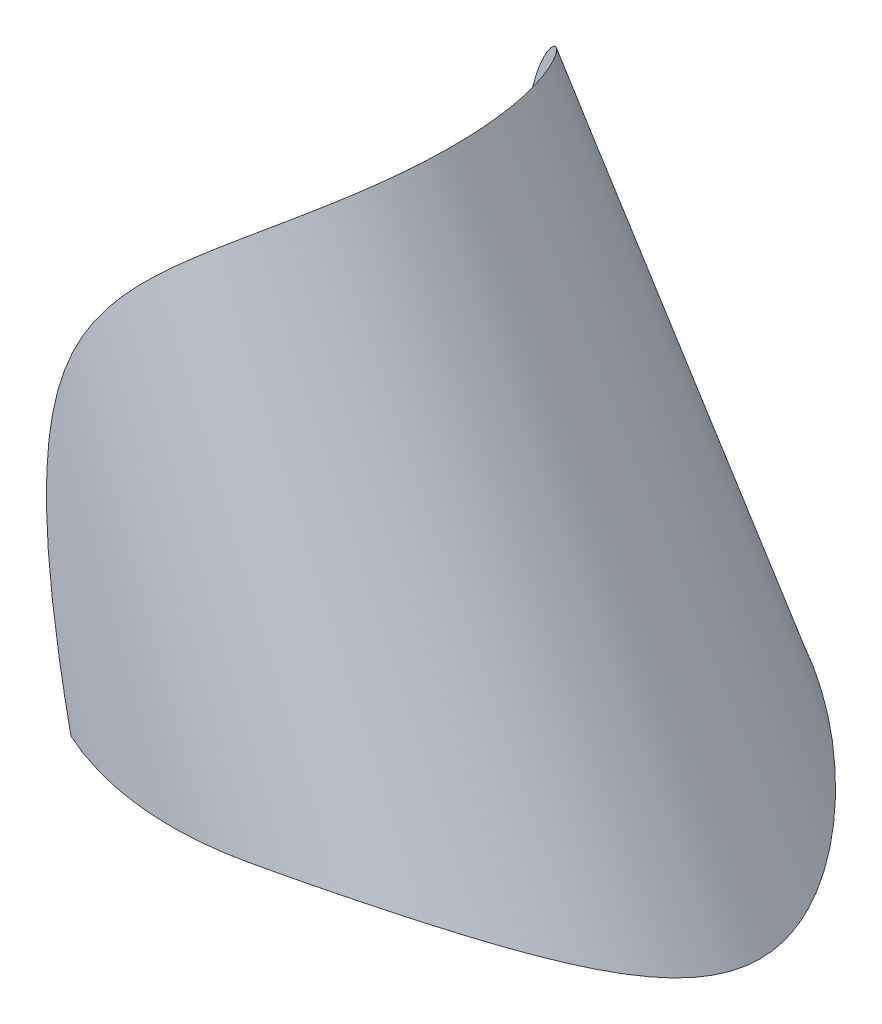
ISO-10303-21;
HEADER;
FILE_DESCRIPTION(('STEP AP214'),'2;1');
FILE_NAME('part.step','',(''),(''),'','','');
FILE_SCHEMA(('AUTOMOTIVE_DESIGN { 1 0 10303 214 1 1 1 1 }'));
ENDSEC;
DATA;
#1=APPLICATION_CONTEXT('core data for automotive mechanical design processes');
#2=APPLICATION_PROTOCOL_DEFINITION('international standard','automotive_design',2000,#1);
#3=PRODUCT_CONTEXT('',#1,'mechanical');
#4=PRODUCT('Part','Part','',(#3));
#5=PRODUCT_RELATED_PRODUCT_CATEGORY('part','',(#4));
#6=PRODUCT_DEFINITION_FORMATION('','',#4);
#7=PRODUCT_DEFINITION_CONTEXT('part definition',#1,'design');
#8=PRODUCT_DEFINITION('design','',#6,#7);
#9=PRODUCT_DEFINITION_SHAPE('','',#8);
#10=(LENGTH_UNIT() NAMED_UNIT(*) SI_UNIT(.MILLI.,.METRE.));
#11=(NAMED_UNIT(*) PLANE_ANGLE_UNIT() SI_UNIT($,.RADIAN.));
#12=(NAMED_UNIT(*) SI_UNIT($,.STERADIAN.) SOLID_ANGLE_UNIT());
#13=UNCERTAINTY_MEASURE_WITH_UNIT(LENGTH_MEASURE(1.E-05),#10,'distance_accuracy_value','');
#14=(GEOMETRIC_REPRESENTATION_CONTEXT(3) GLOBAL_UNCERTAINTY_ASSIGNED_CONTEXT((#13)) GLOBAL_UNIT_ASSIGNED_CONTEXT((#10,
#11,#12)) REPRESENTATION_CONTEXT('',''));
#15=CARTESIAN_POINT('',(0.,0.,0.));
#16=DIRECTION('',(0.,0.,1.));
#17=DIRECTION('',(1.,0.,0.));
#18=AXIS2_PLACEMENT_3D('',#15,#16,#17);
#19=CARTESIAN_POINT('',(35.761144135082,-12.3779103548701,0.));
#20=DIRECTION('',(0.422618261740701,-0.90630778703665,0.));
#21=DIRECTION('',(0.90630778703665,0.422618261740701,0.));
#22=AXIS2_PLACEMENT_3D('',#19,#20,#21);
#23=CONICAL_SURFACE('',#22,17.4576231620508,0.0737888713049141);
#24=CARTESIAN_POINT('',(34.9998,-6.66633415136175E-10,15.9715201922678));
#25=CARTESIAN_POINT('',(35.3236106019589,1.21896389362089E-05,15.8985949983167));
#26=CARTESIAN_POINT('',(35.6457566196141,-0.00523801429899876,15.8184619106437));
#27=CARTESIAN_POINT('',(36.2859291135126,-0.0258651280964723,15.6445389671018));
#28=CARTESIAN_POINT('',(36.603956631235,-0.0412394247097111,15.5507526402926));
#29=CARTESIAN_POINT('',(37.2347878928871,-0.0816861594505489,15.3503968317469));
#30=CARTESIAN_POINT('',(37.547598867677,-0.106743762494247,15.243847075393));
#31=CARTESIAN_POINT('',(38.1678938774959,-0.166100414670665,15.0185456320081));
#32=CARTESIAN_POINT('',(38.4753775627621,-0.200400068161014,14.8997931473285));
#33=CARTESIAN_POINT('',(39.3857774464943,-0.316037703904624,14.5275389271616));
#34=CARTESIAN_POINT('',(39.9801681759951,-0.410350576382221,14.2569091054032));
#35=CARTESIAN_POINT('',(41.1424612274792,-0.629602651400756,13.6743031790235));
#36=CARTESIAN_POINT('',(41.7103546041193,-0.754552108885808,13.3623132460812));
#37=CARTESIAN_POINT('',(42.7531915857906,-1.01478481672398,12.7383797502337));
#38=CARTESIAN_POINT('',(43.231318093652,-1.1472314506972,12.4305491657047));
#39=CARTESIAN_POINT('',(44.162720997008,-1.42936387725979,11.7866331874438));
#40=CARTESIAN_POINT('',(44.6160001283303,-1.57904776628591,11.4505509147375));
#41=CARTESIAN_POINT('',(45.4962669147002,-1.89222754719716,10.750365346246));
#42=CARTESIAN_POINT('',(45.9232222923253,-2.05573983475431,10.3862288347197));
#43=CARTESIAN_POINT('',(46.7476461213269,-2.3921969668163,9.63006480063052));
#44=CARTESIAN_POINT('',(47.1451208152106,-2.56513980087611,9.23804321734555));
#45=CARTESIAN_POINT('',(47.7906270325496,-2.86174653797912,8.5489215256416));
#46=CARTESIAN_POINT('',(48.0472413267373,-2.98433902651925,8.25937275591793));
#47=CARTESIAN_POINT('',(48.5427619020432,-3.22930835222771,7.66533625103925));
#48=CARTESIAN_POINT('',(48.7816677647473,-3.35168518423387,7.36084816318106));
#49=CARTESIAN_POINT('',(49.2391442827699,-3.59330475618336,6.73628447834634));
#50=CARTESIAN_POINT('',(49.4577394997404,-3.71255115311547,6.41622844087328));
#51=CARTESIAN_POINT('',(49.8715846401084,-3.94443837230913,5.75927613155288));
#52=CARTESIAN_POINT('',(50.066842596561,-4.05708146069197,5.42238571131998));
#53=CARTESIAN_POINT('',(50.5009701665426,-4.31332071603084,4.59483623128071));
#54=CARTESIAN_POINT('',(50.7270640019017,-4.45181074995566,4.09553436054531));
#55=CARTESIAN_POINT('',(51.0139455467475,-4.63138804062697,3.32131543754791));
#56=CARTESIAN_POINT('',(51.1008260791665,-4.68652932180488,3.05919759864938));
#57=CARTESIAN_POINT('',(51.2549539647546,-4.78522612355182,2.52705891847308));
#58=CARTESIAN_POINT('',(51.3222061289072,-4.82878448290345,2.25704003165284));
#59=CARTESIAN_POINT('',(51.4249190183286,-4.89571522509741,1.75863040295888));
#60=CARTESIAN_POINT('',(51.463888686534,-4.92128919409274,1.53125661089695));
#61=CARTESIAN_POINT('',(51.525889723738,-4.96210157787142,1.07344238082426));
#62=CARTESIAN_POINT('',(51.5489246021192,-4.97734226837948,0.843002629443815));
#63=CARTESIAN_POINT('',(51.5783574940423,-4.99683259185722,0.380724014227866));
#64=CARTESIAN_POINT('',(51.5847651520737,-5.00108859640054,0.148886039684123));
#65=CARTESIAN_POINT('',(51.5807682362409,-4.99843745461161,-0.314586475423503));
#66=CARTESIAN_POINT('',(51.5703631855512,-4.99152999167199,-0.546221010031202));
#67=CARTESIAN_POINT('',(51.5331143814726,-4.96688956752888,-1.00700239792166));
#68=CARTESIAN_POINT('',(51.5063103362027,-4.9491827559233,-1.23615390368811));
#69=CARTESIAN_POINT('',(51.4370905221284,-4.90371024972512,-1.69104678508334));
#70=CARTESIAN_POINT('',(51.394674670021,-4.87594450145913,-1.91678814250925));
#71=CARTESIAN_POINT('',(51.2952918651559,-4.81137232716704,-2.36394999235031));
#72=CARTESIAN_POINT('',(51.2383097535403,-4.77455648440265,-2.58536572318594));
#73=CARTESIAN_POINT('',(51.1110799430504,-4.69310746958649,-3.02290951473974));
#74=CARTESIAN_POINT('',(51.0408280775049,-4.64847184246102,-3.23903589047043));
#75=CARTESIAN_POINT('',(50.8408519182675,-4.52278056135886,-3.79839483568863));
#76=CARTESIAN_POINT('',(50.7013403054213,-4.4363577083505,-4.13694375134363));
#77=CARTESIAN_POINT('',(50.3958508417003,-4.25121979205632,-4.79838270935109));
#78=CARTESIAN_POINT('',(50.2298561578252,-4.1524969195128,-5.1212626208891));
#79=CARTESIAN_POINT('',(49.8750352702454,-3.94667926708684,-5.75269697108235));
#80=CARTESIAN_POINT('',(49.6861423082242,-3.8395603463165,-6.06120570779895));
#81=CARTESIAN_POINT('',(49.2891308332762,-3.62061146228198,-6.66371208711769));
#82=CARTESIAN_POINT('',(49.0810139544637,-3.50878189988105,-6.95771095986596));
#83=CARTESIAN_POINT('',(48.6800410221942,-3.29981722222508,-7.48954876407096));
#84=CARTESIAN_POINT('',(48.4894971503143,-3.202961688091,-7.72925148515636));
#85=CARTESIAN_POINT('',(48.0972797439064,-3.00909082924798,-8.19932483780465));
#86=CARTESIAN_POINT('',(47.8956047394327,-2.91207548508402,-8.42969422983568));
#87=CARTESIAN_POINT('',(47.2750677346216,-2.62243991193183,-9.1076217014282));
#88=CARTESIAN_POINT('',(46.8408151128199,-2.43129430740816,-9.5418403069697));
#89=CARTESIAN_POINT('',(45.9359734576777,-2.05998652163755,-10.3769973249598));
#90=CARTESIAN_POINT('',(45.4653321046796,-1.87984084754257,-10.7778860314504));
#91=CARTESIAN_POINT('',(44.4917168111245,-1.53644949491877,-11.5459918138434));
#92=CARTESIAN_POINT('',(43.9887514538438,-1.37319935977933,-11.913217766183));
#93=CARTESIAN_POINT('',(42.9334680006547,-1.0625851233868,-12.6263028274038));
#94=CARTESIAN_POINT('',(42.3800035969068,-0.916053359143263,-12.9708320222139));
#95=CARTESIAN_POINT('',(41.2435037226156,-0.651078763661304,-13.6202332446031));
#96=CARTESIAN_POINT('',(40.660458984848,-0.532644801973639,-13.925092736088));
#97=CARTESIAN_POINT('',(39.4705750121767,-0.328855418894965,-14.4900184843783));
#98=CARTESIAN_POINT('',(38.86384885727,-0.243359968363017,-14.7502716905924));
#99=CARTESIAN_POINT('',(37.6283671275972,-0.108914736376815,-15.2225911984207));
#100=CARTESIAN_POINT('',(36.9996345730258,-0.0599278940019931,-15.4347062138815));
#101=CARTESIAN_POINT('',(36.1373032361046,-0.0207159163992346,-15.6854317294684));
#102=CARTESIAN_POINT('',(35.9111004889348,-0.0129766856431932,-15.7475415036412));
#103=CARTESIAN_POINT('',(35.4568161415276,-0.00261864026939501,-15.8648051701907));
#104=CARTESIAN_POINT('',(35.2287347931783,8.49945480762432E-07,-15.9199599794407));
#105=CARTESIAN_POINT('',(34.9998000000001,-6.66633415136175E-10,-15.9715201922678));
#106=B_SPLINE_CURVE_WITH_KNOTS('',3,(#24,#25,#26,#27,#28,#29,#30,#31,#32,#33,#34,#35,#36,#37,
#38,#39,#40,#41,#42,#43,#44,#45,#46,#47,#48,#49,#50,#51,#52,#53,#54,#55,#56,#57,#58,#59,#60,#61,
#62,#63,#64,#65,#66,#67,#68,#69,#70,#71,#72,#73,#74,#75,#76,#77,#78,#79,#80,#81,#82,#83,#84,#85,
#86,#87,#88,#89,#90,#91,#92,#93,#94,#95,#96,#97,#98,#99,#100,#101,#102,#103,#104,#105),
.UNSPECIFIED.,.F.,.F.,(4,2,2,2,2,2,2,2,2,2,2,2,2,2,2,2,2,2,2,2,2,2,2,2,2,2,2,2,2,2,2,2,2,2,2,2,
2,2,2,2,4),(0.,0.995577911287905,1.99089894315927,2.98470112349125,3.97856830647105,
5.95521750419811,7.93252924855473,9.68266409905775,11.4326058617793,13.1846523434663,
14.9363267654744,16.1533207254938,17.3703434314276,18.5858746972304,19.8009863454901,
21.4909470450744,22.3349071317374,23.1786601867043,23.8742387479578,24.5696640703388,
25.2646859264312,25.9597274944004,26.6530927302643,27.3464616659054,28.0405551374201,
28.7348669160347,29.8616660633841,30.9891842940889,32.1200725694127,33.2508648027594,
34.2140026468324,35.1772679858848,37.1044262268181,39.0344087888688,40.9638809664493,
42.9661905535393,44.9691313653109,46.9634607022651,48.9557627712058,49.6597386130863,
50.3636215525695),.UNSPECIFIED.);
#107=CARTESIAN_POINT('',(35.,0.,15.971475149572));
#108=VERTEX_POINT('',#107);
#109=CARTESIAN_POINT('',(35.,0.,-15.971475149572));
#110=VERTEX_POINT('',#109);
#111=EDGE_CURVE('E72',#108,#110,#106,.T.);
#112=ORIENTED_EDGE('',*,*,#111,.T.);
#113=CARTESIAN_POINT('',(30.6155649735812,0.,0.));
#114=DIRECTION('',(0.,1.,0.));
#115=DIRECTION('',(1.,0.,0.));
#116=AXIS2_PLACEMENT_3D('',#113,#114,#115);
#117=ELLIPSE('',#116,18.1699698407046,16.4577985023139);
#118=CARTESIAN_POINT('',(22.383079870548,0.,-14.6716151587412));
#119=VERTEX_POINT('',#118);
#120=EDGE_CURVE('E75',#110,#119,#117,.T.);
#121=ORIENTED_EDGE('',*,*,#120,.T.);
#122=CARTESIAN_POINT('',(25.7131063626137,-19.7560207097402,-12.7143841686711));
#123=CARTESIAN_POINT('',(25.594559300573,-19.1210129735165,-12.8049429413743));
#124=CARTESIAN_POINT('',(25.4765837975891,-18.48546607117,-12.8924490985651));
#125=CARTESIAN_POINT('',(25.2419814738424,-17.2133548988873,-13.0616510436959));
#126=CARTESIAN_POINT('',(25.125354643854,-16.5767906359442,-13.143346871401));
#127=CARTESIAN_POINT('',(24.8936426136106,-15.3026365902899,-13.301231738088));
#128=CARTESIAN_POINT('',(24.7785575606253,-14.6650467160366,-13.3774202540269));
#129=CARTESIAN_POINT('',(24.550187722142,-13.3889373322082,-13.5245236706672));
#130=CARTESIAN_POINT('',(24.4369029405213,-12.750417820634,-13.5954385600119));
#131=CARTESIAN_POINT('',(24.0988172223956,-10.8258676161365,-13.8014160293032));
#132=CARTESIAN_POINT('',(23.8771740922695,-9.5384489670661,-13.9287742539516));
#133=CARTESIAN_POINT('',(23.4452293408763,-6.96007635171749,-14.1643557434416));
#134=CARTESIAN_POINT('',(23.2349266966466,-5.66912271538673,-14.2725807361999));
#135=CARTESIAN_POINT('',(22.9266656591747,-3.70028909842193,-14.423426052111));
#136=CARTESIAN_POINT('',(22.8229842982922,-3.02380948409516,-14.4727089586236));
#137=CARTESIAN_POINT('',(22.620815842554,-1.66973320460413,-14.5663033830801));
#138=CARTESIAN_POINT('',(22.5223287011033,-0.992136549516615,-14.6106149456237));
#139=CARTESIAN_POINT('',(22.3316031985857,0.364490410422137,-14.6942726112136));
#140=CARTESIAN_POINT('',(22.2393670597683,1.04352113754538,-14.733616952643));
#141=CARTESIAN_POINT('',(22.0625989948323,2.40285618579336,-14.8072298734886));
#142=CARTESIAN_POINT('',(21.9780669580327,3.08316048847793,-14.841498525829));
#143=CARTESIAN_POINT('',(21.8187827282326,4.44323740977862,-14.9046665639965));
#144=CARTESIAN_POINT('',(21.7440038262124,5.12300618768377,-14.9335807085325));
#145=CARTESIAN_POINT('',(21.6063941040536,6.48403463017543,-14.9857853749735));
#146=CARTESIAN_POINT('',(21.5435640890665,7.16529439210248,-15.009075517945));
#147=CARTESIAN_POINT('',(21.4332266073462,8.52882751993413,-15.0493686534911));
#148=CARTESIAN_POINT('',(21.3857095136932,9.21109997704182,-15.066375597173));
#149=CARTESIAN_POINT('',(21.3105200823282,10.5768479980342,-15.0930453589762));
#150=CARTESIAN_POINT('',(21.2828440334463,11.2603233129426,-15.1027095505434));
#151=CARTESIAN_POINT('',(21.2633960497107,12.1776986361535,-15.1094895830045));
#152=CARTESIAN_POINT('',(21.2599821305458,12.4113369615638,-15.1106779292565));
#153=CARTESIAN_POINT('',(21.2565765016492,12.8786500254832,-15.1118632378284));
#154=CARTESIAN_POINT('',(21.2565848713995,13.112324764712,-15.1118601724779));
#155=CARTESIAN_POINT('',(21.2603858222622,13.5796789112207,-15.1105376051501));
#156=CARTESIAN_POINT('',(21.2641789807155,13.8133583137737,-15.1092179023295));
#157=CARTESIAN_POINT('',(21.2759681273656,14.2805944319035,-15.1051048428038));
#158=CARTESIAN_POINT('',(21.2839640993467,14.5141511479503,-15.1023114917844));
#159=CARTESIAN_POINT('',(21.3149219416393,15.2142022571781,-15.0914593116835));
#160=CARTESIAN_POINT('',(21.3448550869247,15.6803882168754,-15.0809279338576));
#161=CARTESIAN_POINT('',(21.4276591988929,16.6105024691406,-15.0513294649539));
#162=CARTESIAN_POINT('',(21.4805279323643,17.0744309770679,-15.0322632049019));
#163=CARTESIAN_POINT('',(21.6041787181324,17.9267935023847,-14.9865543380581));
#164=CARTESIAN_POINT('',(21.6709637846059,18.3158816166451,-14.9615245679196));
#165=CARTESIAN_POINT('',(21.8282819759564,19.0885256124742,-14.9009493240884));
#166=CARTESIAN_POINT('',(21.9188156622328,19.4720813630358,-14.865403601804));
#167=CARTESIAN_POINT('',(22.1266763369141,20.2289665228281,-14.7809473113215));
#168=CARTESIAN_POINT('',(22.2439041496263,20.6023281953352,-14.7320860847196));
#169=CARTESIAN_POINT('',(22.5078851319548,21.335801269247,-14.6173921066452));
#170=CARTESIAN_POINT('',(22.6546258133629,21.6959181991085,-14.55156653024));
#171=CARTESIAN_POINT('',(22.9419312438359,22.3190616471428,-14.4162658364815));
#172=CARTESIAN_POINT('',(23.0765032793869,22.5857528769604,-14.3509184581417));
#173=CARTESIAN_POINT('',(23.3629157621605,23.1057027413724,-14.206097804071));
#174=CARTESIAN_POINT('',(23.5147542379377,23.3589629046649,-14.1266261404389));
#175=CARTESIAN_POINT('',(23.8339003122097,23.8501632399731,-13.9521701916084));
#176=CARTESIAN_POINT('',(24.0012174136999,24.0880938464151,-13.8571763488845));
#177=CARTESIAN_POINT('',(24.3484261169118,24.5470850727225,-13.6508071556338));
#178=CARTESIAN_POINT('',(24.5283184374123,24.7681447267591,-13.5394308683114));
#179=CARTESIAN_POINT('',(24.8966338543795,25.1920143358552,-13.3002978634118));
#180=CARTESIAN_POINT('',(25.0850245741582,25.3948859942365,-13.1726003941349));
#181=CARTESIAN_POINT('',(25.4674181766287,25.7833660092674,-12.9005058262877));
#182=CARTESIAN_POINT('',(25.661421149426,25.9689740885457,-12.7561084594863));
#183=CARTESIAN_POINT('',(26.0518291994712,26.3237043658231,-12.4507906103846));
#184=CARTESIAN_POINT('',(26.2482361166182,26.4928129155924,-12.2898566713686));
#185=CARTESIAN_POINT('',(26.6402417749003,26.8153234077145,-11.9520799546022));
#186=CARTESIAN_POINT('',(26.8358404723167,26.9687245108136,-11.7752363277397));
#187=CARTESIAN_POINT('',(27.2415652095083,27.2744713337232,-11.3891495504914));
#188=CARTESIAN_POINT('',(27.4513517689166,27.4253937752012,-11.1784227381595));
#189=CARTESIAN_POINT('',(27.8637414762264,27.7111420899488,-10.7397529836794));
#190=CARTESIAN_POINT('',(28.0663443433784,27.845967334602,-10.5118093697599));
#191=CARTESIAN_POINT('',(28.4618676363501,28.1008177252333,-10.039755463126));
#192=CARTESIAN_POINT('',(28.6547864928193,28.2208404769431,-9.7956425648571));
#193=CARTESIAN_POINT('',(29.0287748157629,28.4471751774606,-9.29243430301671));
#194=CARTESIAN_POINT('',(29.2098433582326,28.5534860577384,-9.03333777408633));
#195=CARTESIAN_POINT('',(29.5875154921181,28.7700829196144,-8.45678467544716));
#196=CARTESIAN_POINT('',(29.7816379827667,28.878049860466,-8.13682404108838));
#197=CARTESIAN_POINT('',(30.1488053761202,29.0777700396268,-7.48016458621192));
#198=CARTESIAN_POINT('',(30.3218482342939,29.1695217055914,-7.14346414653906));
#199=CARTESIAN_POINT('',(30.6448952284094,29.337767081197,-6.45535099373017));
#200=CARTESIAN_POINT('',(30.7948908688881,29.4142551676003,-6.10393291595904));
#201=CARTESIAN_POINT('',(31.0701110655069,29.5526378690155,-5.38874559945974));
#202=CARTESIAN_POINT('',(31.1953355382617,29.6145324349026,-5.02497631915954));
#203=CARTESIAN_POINT('',(31.4250746236543,29.7268889822425,-4.26969000986297));
#204=CARTESIAN_POINT('',(31.5283069114707,29.7766597355748,-3.87767915514783));
#205=CARTESIAN_POINT('',(31.7049388588305,29.8611790991321,-3.08539190963087));
#206=CARTESIAN_POINT('',(31.7783373509107,29.8959271214872,-2.68511519601142));
#207=CARTESIAN_POINT('',(31.8944843848026,29.9506786398236,-1.87913318661852));
#208=CARTESIAN_POINT('',(31.9372323407685,29.9706818539769,-1.47342778723363));
#209=CARTESIAN_POINT('',(31.9916053672478,29.9960957600351,-0.659486326166498));
#210=CARTESIAN_POINT('',(32.0032307489908,30.0015065978656,-0.25125028983186));
#211=CARTESIAN_POINT('',(31.9952317627995,29.9977764415101,0.564933072863193));
#212=CARTESIAN_POINT('',(31.9756009662538,29.9886324537619,0.972880322561809));
#213=CARTESIAN_POINT('',(31.9052923051069,29.9557181206458,1.78549677640663));
#214=CARTESIAN_POINT('',(31.8546143489936,29.9319477321663,2.19016597088715));
#215=CARTESIAN_POINT('',(31.7227734417863,29.8695982289604,2.99332516078179));
#216=CARTESIAN_POINT('',(31.6416122893316,29.8310199879579,3.39181551932953));
#217=CARTESIAN_POINT('',(31.4497101191649,29.7387399785187,4.17982042615428));
#218=CARTESIAN_POINT('',(31.3389691182999,29.6850382186954,4.56933497954327));
#219=CARTESIAN_POINT('',(31.089179297739,29.5620459285882,5.33661191984449));
#220=CARTESIAN_POINT('',(30.9501328970611,29.4927567303749,5.71437530784902));
#221=CARTESIAN_POINT('',(30.6453597008737,29.3379248660823,6.45553914894328));
#222=CARTESIAN_POINT('',(30.4796327347444,29.2523820960624,6.81893951016416));
#223=CARTESIAN_POINT('',(30.1234475613308,29.0640971918596,7.52901496615659));
#224=CARTESIAN_POINT('',(29.9329769079071,28.9613463944214,7.87568152259973));
#225=CARTESIAN_POINT('',(29.529871320546,28.7374850219668,8.54966374566895));
#226=CARTESIAN_POINT('',(29.3172366458565,28.6163746616906,8.87697963856546));
#227=CARTESIAN_POINT('',(28.8726235089253,28.3541235117768,9.51027750268545));
#228=CARTESIAN_POINT('',(28.6406260825247,28.212962987483,9.81623800671994));
#229=CARTESIAN_POINT('',(28.1611695967101,27.9087481246736,10.4043191341007));
#230=CARTESIAN_POINT('',(27.9137091844434,27.7456918690682,10.6864376664253));
#231=CARTESIAN_POINT('',(27.4081921824308,27.395560385312,11.2244937789923));
#232=CARTESIAN_POINT('',(27.1501468898517,27.2085103340566,11.4804583041429));
#233=CARTESIAN_POINT('',(26.6288785993395,26.80770339413,11.9646701627206));
#234=CARTESIAN_POINT('',(26.3656573090467,26.5939551930423,12.1929264649823));
#235=CARTESIAN_POINT('',(25.9034477860258,26.1917412141888,12.5693390575419));
#236=CARTESIAN_POINT('',(25.704102688666,26.0093916761028,12.7236201116718));
#237=CARTESIAN_POINT('',(25.3098438173809,25.6269403803244,13.014869321128));
#238=CARTESIAN_POINT('',(25.11492928358,25.4268416960501,13.1518404638938));
#239=CARTESIAN_POINT('',(24.7335342456449,25.0088720467023,13.4081359985188));
#240=CARTESIAN_POINT('',(24.5470399823781,24.7910318361923,13.5274899599297));
#241=CARTESIAN_POINT('',(24.1857785425139,24.3376258921375,13.7491077799658));
#242=CARTESIAN_POINT('',(24.0110113246472,24.1020602209773,13.8513716987352));
#243=CARTESIAN_POINT('',(23.6761372914032,23.6139728140196,14.0397266758798));
#244=CARTESIAN_POINT('',(23.5160553391774,23.3614235322143,14.1257905564346));
#245=CARTESIAN_POINT('',(23.2132520966819,22.841675115135,14.2827909385791));
#246=CARTESIAN_POINT('',(23.0705306101441,22.5744761455319,14.3537276111958));
#247=CARTESIAN_POINT('',(22.8036180137101,22.0277329585437,14.4821528157048));
#248=CARTESIAN_POINT('',(22.6794371815758,21.7481820044479,14.5396338986234));
#249=CARTESIAN_POINT('',(22.4497934295326,21.1794117019202,14.642951724059));
#250=CARTESIAN_POINT('',(22.344333219197,20.8901909610962,14.6887867813747));
#251=CARTESIAN_POINT('',(22.1726860670101,20.3692878157092,14.7615915010955));
#252=CARTESIAN_POINT('',(22.1029708939396,20.1390188966689,14.7904917137139));
#253=CARTESIAN_POINT('',(21.9737692472292,19.6750369570714,14.8431436952888));
#254=CARTESIAN_POINT('',(21.9142842600069,19.4413234413709,14.8668947162126));
#255=CARTESIAN_POINT('',(21.7499996066097,18.7360485729906,14.9315656308563));
#256=CARTESIAN_POINT('',(21.6594226710229,18.2605163207335,14.9658817879507));
#257=CARTESIAN_POINT('',(21.5470245055632,17.5420758700457,15.007730405409));
#258=CARTESIAN_POINT('',(21.5134144577949,17.301120765223,15.0200947090227));
#259=CARTESIAN_POINT('',(21.4533542430296,16.8181720136499,15.0420074175973));
#260=CARTESIAN_POINT('',(21.4269041426971,16.576178357251,15.05155579634));
#261=CARTESIAN_POINT('',(21.3804461354725,16.091601062096,15.0682247469156));
#262=CARTESIAN_POINT('',(21.360435685621,15.8490176944344,15.0753462771545));
#263=CARTESIAN_POINT('',(21.3261791776237,15.3634043464458,15.0874828808966));
#264=CARTESIAN_POINT('',(21.3119329771239,15.120374377297,15.0924980064198));
#265=CARTESIAN_POINT('',(21.2771634188382,14.3958966806431,15.1047077109724));
#266=CARTESIAN_POINT('',(21.2641551272357,13.9140366256181,15.1092270603821));
#267=CARTESIAN_POINT('',(21.2543876330015,12.9501007483811,15.1126236158813));
#268=CARTESIAN_POINT('',(21.2576317613484,12.4680249021876,15.1114996653606));
#269=CARTESIAN_POINT('',(21.2773227248779,11.5038378841845,15.1046340046742));
#270=CARTESIAN_POINT('',(21.2937793759624,11.0217269526747,15.098888861307));
#271=CARTESIAN_POINT('',(21.3375009031468,10.0581101947944,15.0834881100146));
#272=CARTESIAN_POINT('',(21.3647650381414,9.5766043292032,15.0738327702237));
#273=CARTESIAN_POINT('',(21.4283007372355,8.61299392638094,15.0510694065963));
#274=CARTESIAN_POINT('',(21.4645960426872,8.13089119798247,15.0379522767238));
#275=CARTESIAN_POINT('',(21.5446571882956,7.16740177338675,15.0086172995573));
#276=CARTESIAN_POINT('',(21.5884231340383,6.6860150874067,14.9923994084383));
#277=CARTESIAN_POINT('',(21.6822093643538,5.72415792392129,14.9571054805477));
#278=CARTESIAN_POINT('',(21.7322271094166,5.24368715436752,14.9380306036766));
#279=CARTESIAN_POINT('',(21.8375788817861,4.2834413255563,14.8971766074534));
#280=CARTESIAN_POINT('',(21.8929129888018,3.80366627683939,14.8753974475542));
#281=CARTESIAN_POINT('',(22.0661455769388,2.36150101231084,14.8059903490614));
#282=CARTESIAN_POINT('',(22.1908857957902,1.40011841879326,14.754435919835));
#283=CARTESIAN_POINT('',(22.4538420472052,-0.520266241417525,14.641326662264));
#284=CARTESIAN_POINT('',(22.5920592470569,-1.47926809451655,14.579770967367));
#285=CARTESIAN_POINT('',(22.8785503154358,-3.3936313036773,14.4468147437213));
#286=CARTESIAN_POINT('',(23.0268091087462,-4.34899593843173,14.3754288134169));
#287=CARTESIAN_POINT('',(23.3312624053057,-6.25761331256524,14.2225743058556));
#288=CARTESIAN_POINT('',(23.4874566431902,-7.2108661214536,14.1411060656246));
#289=CARTESIAN_POINT('',(23.8097022155389,-9.13688312410815,13.965778288726));
#290=CARTESIAN_POINT('',(23.9758965071725,-10.1096016901475,13.8716804297693));
#291=CARTESIAN_POINT('',(24.3135287005389,-12.0532657071781,13.6720053514268));
#292=CARTESIAN_POINT('',(24.484968233982,-13.0242105047616,13.5664245332378));
#293=CARTESIAN_POINT('',(24.8307142487901,-14.9567682923457,13.3439292783367));
#294=CARTESIAN_POINT('',(25.0049900316306,-15.9183970798942,13.2271047188065));
#295=CARTESIAN_POINT('',(25.2688424904954,-17.3589964359862,13.0422422897481));
#296=CARTESIAN_POINT('',(25.357186059708,-17.8388155843392,12.9790276315786));
#297=CARTESIAN_POINT('',(25.5346124590745,-18.797865797861,12.8492504513119));
#298=CARTESIAN_POINT('',(25.6236952919372,-19.2770968608675,12.7826879169435));
#299=CARTESIAN_POINT('',(25.7131063626137,-19.7560207097402,12.7143841686711));
#300=B_SPLINE_CURVE_WITH_KNOTS('',3,(#122,#123,#124,#125,#126,#127,#128,#129,#130,#131,#132,
#133,#134,#135,#136,#137,#138,#139,#140,#141,#142,#143,#144,#145,#146,#147,#148,#149,#150,#151,
#152,#153,#154,#155,#156,#157,#158,#159,#160,#161,#162,#163,#164,#165,#166,#167,#168,#169,#170,
#171,#172,#173,#174,#175,#176,#177,#178,#179,#180,#181,#182,#183,#184,#185,#186,#187,#188,#189,
#190,#191,#192,#193,#194,#195,#196,#197,#198,#199,#200,#201,#202,#203,#204,#205,#206,#207,#208,
#209,#210,#211,#212,#213,#214,#215,#216,#217,#218,#219,#220,#221,#222,#223,#224,#225,#226,#227,
#228,#229,#230,#231,#232,#233,#234,#235,#236,#237,#238,#239,#240,#241,#242,#243,#244,#245,#246,
#247,#248,#249,#250,#251,#252,#253,#254,#255,#256,#257,#258,#259,#260,#261,#262,#263,#264,#265,
#266,#267,#268,#269,#270,#271,#272,#273,#274,#275,#276,#277,#278,#279,#280,#281,#282,#283,#284,
#285,#286,#287,#288,#289,#290,#291,#292,#293,#294,#295,#296,#297,#298,#299),.UNSPECIFIED.,.F.,
.F.,(4,2,2,2,2,2,2,2,2,2,2,2,2,2,2,2,2,2,2,2,2,2,2,2,2,2,2,2,2,2,2,2,2,2,2,2,2,2,2,2,2,2,2,2,2,
2,2,2,2,2,2,2,2,2,2,2,2,2,2,2,2,2,2,2,2,2,2,2,2,2,2,2,2,2,2,2,2,2,2,2,2,2,2,2,2,2,2,2,4),(0.,
1.95687401015611,3.91373462645859,5.87078084716462,7.82783128222826,11.7652875624646,
15.7023880703273,17.7608100615353,19.8192135844103,21.8783450781921,23.9374469848181,
25.9907860195207,28.0442633653154,30.0964472020241,32.148247087603,32.8492240749461,
33.5502173423594,34.2513175573648,34.9524150673281,36.3536789339334,37.7548063917331,
38.9407957448815,40.1268131364555,41.3084940477238,42.4896759852478,43.4060103221538,
44.3222401388078,45.2390362495394,46.1558848057276,47.069494881977,47.9831196345228,
48.8974938316593,49.8119168586277,50.8113305757916,51.8107833085977,52.8103974891102,
53.8100895199172,54.9772990072562,56.1446216132398,57.3123734804771,58.4801292785567,
59.7039278770936,60.9277743610036,62.1516442365567,63.3755018732152,64.5996112591942,
65.8237242532729,67.0477650307716,68.2718051111287,69.4957406272401,70.7196839706259,
71.9442453619113,73.1687924313695,74.3945532398709,75.6204214404234,76.8450136911411,
78.0692084923726,79.0016305962017,79.933891557104,80.864569523468,81.795244214472,
82.7274665913165,83.6596784279738,84.5924051202297,85.5252667029983,86.2519177465968,
86.9786742815298,88.4327043052477,89.1634368814451,89.8941762610792,90.624626723287,
91.3550591451951,92.8007964097572,94.2468299943069,95.69393886727,97.1409485243044,
98.5918030637083,100.042678110427,101.492965708706,102.943275054749,105.855500877153,
108.767979161981,111.676177985351,114.584279621288,117.55806752964,120.532790134817,
123.485447485308,124.96132423272,126.437206390185),.UNSPECIFIED.);
#301=CARTESIAN_POINT('',(22.383079870548,0.,14.6716151587412));
#302=VERTEX_POINT('',#301);
#303=EDGE_CURVE('E80',#119,#302,#300,.T.);
#304=ORIENTED_EDGE('',*,*,#303,.T.);
#305=EDGE_CURVE('E45',#302,#108,#117,.T.);
#306=ORIENTED_EDGE('',*,*,#305,.T.);
#307=EDGE_LOOP('',(#112,#121,#304,#306));
#308=FACE_BOUND('',#307,.T.);
#309=ADVANCED_FACE('F26',(#308),#23,.T.);
#310=CARTESIAN_POINT('',(18.9200115891599,23.7380149390786,0.));
#311=DIRECTION('',(0.422618261740701,-0.90630778703665,0.));
#312=DIRECTION('',(0.90630778703665,0.422618261740701,0.));
#313=AXIS2_PLACEMENT_3D('',#310,#311,#312);
#314=CONICAL_SURFACE('',#313,12.5063669200782,0.0737888713049139);
#315=CARTESIAN_POINT('',(34.9998000000001,-6.66633415136175E-10,-13.8748647295455));
#316=CARTESIAN_POINT('',(35.2807728729391,5.90246393943916E-06,-13.8007518115016));
#317=CARTESIAN_POINT('',(35.5600120729893,-0.00394453437158771,-13.7203337626938));
#318=CARTESIAN_POINT('',(36.1144530733763,-0.0194252961287128,-13.5474108599767));
#319=CARTESIAN_POINT('',(36.389655658539,-0.0309541270892313,-13.4549083911998));
#320=CARTESIAN_POINT('',(37.2078383344148,-0.0763738693337686,-13.1602566587078));
#321=CARTESIAN_POINT('',(37.7440963816699,-0.121099692766873,-12.9407757344052));
#322=CARTESIAN_POINT('',(38.794823839711,-0.236276929966871,-12.4592157243767));
#323=CARTESIAN_POINT('',(39.3092660398165,-0.306759474225222,-12.1970853045369));
#324=CARTESIAN_POINT('',(40.3124655029773,-0.469746183693614,-11.6332868311782));
#325=CARTESIAN_POINT('',(40.8012180361698,-0.562254386948918,-11.3316115323142));
#326=CARTESIAN_POINT('',(41.6973318485153,-0.753939711314338,-10.7260890651625));
#327=CARTESIAN_POINT('',(42.1077315991654,-0.851263219256311,-10.4261328060198));
#328=CARTESIAN_POINT('',(42.9028800098033,-1.05672752701522,-9.79726186061071));
#329=CARTESIAN_POINT('',(43.2876287295961,-1.16486830161037,-9.46834724186461));
#330=CARTESIAN_POINT('',(44.0279662637933,-1.38802411108244,-8.78197783600083));
#331=CARTESIAN_POINT('',(44.3835814908824,-1.50303275217775,-8.424549493298));
#332=CARTESIAN_POINT('',(45.0618495550885,-1.73540268380997,-7.68044022280999));
#333=CARTESIAN_POINT('',(45.3845171875176,-1.8527628897882,-7.29377256209774));
#334=CARTESIAN_POINT('',(45.8799158260569,-2.04164114434851,-6.63772719603517));
#335=CARTESIAN_POINT('',(46.0642311829336,-2.11418420159773,-6.37735062555723));
#336=CARTESIAN_POINT('',(46.4155090512453,-2.25613595919341,-5.84427694515905));
#337=CARTESIAN_POINT('',(46.5824728853579,-2.32554489822006,-5.5715807766182));
#338=CARTESIAN_POINT('',(46.8965255923252,-2.45908920945015,-5.01426620632566));
#339=CARTESIAN_POINT('',(47.0436450242235,-2.52323262916418,-4.72966704077602));
#340=CARTESIAN_POINT('',(47.3155943269323,-2.64404485747581,-4.14850861379642));
#341=CARTESIAN_POINT('',(47.4404326079805,-2.70071648425491,-3.85195391713394));
#342=CARTESIAN_POINT('',(47.6428675364936,-2.79397522194138,-3.3069496914307));
#343=CARTESIAN_POINT('',(47.7249278680608,-2.83232194112918,-3.06045949851665));
#344=CARTESIAN_POINT('',(47.8710952558073,-2.90126487122066,-2.56125339726514));
#345=CARTESIAN_POINT('',(47.9352122833245,-2.93186538588926,-2.30854103196817));
#346=CARTESIAN_POINT('',(48.0440122567309,-2.9841268828801,-1.79824646514824));
#347=CARTESIAN_POINT('',(48.0887113192815,-3.00579527798048,-1.54066848804237));
#348=CARTESIAN_POINT('',(48.1575636070521,-3.03928786984493,-1.02212280547786));
#349=CARTESIAN_POINT('',(48.1817169758905,-3.05111213542136,-0.761155123726855));
#350=CARTESIAN_POINT('',(48.2088290620446,-3.06439028054371,-0.236768213723162));
#351=CARTESIAN_POINT('',(48.2117001597896,-3.06580128837749,0.0266566835420012));
#352=CARTESIAN_POINT('',(48.1959295311613,-3.0580713993147,0.552694802037785));
#353=CARTESIAN_POINT('',(48.1772881028444,-3.04893064861292,0.81530803446349));
#354=CARTESIAN_POINT('',(48.1190247231977,-3.02052205453726,1.33783244977157));
#355=CARTESIAN_POINT('',(48.0793862717761,-3.00124624681932,1.5977413434915));
#356=CARTESIAN_POINT('',(47.9802151188184,-2.95342855875918,2.11285649350917));
#357=CARTESIAN_POINT('',(47.9206797829884,-2.92488545146582,2.36806212238403));
#358=CARTESIAN_POINT('',(47.7675957155638,-2.85230756523079,2.92941180068402));
#359=CARTESIAN_POINT('',(47.6693999241565,-2.8062292230532,3.23402524764797));
#360=CARTESIAN_POINT('',(47.4482249832075,-2.70427711987721,3.83238768204792));
#361=CARTESIAN_POINT('',(47.325239512817,-2.6484008610889,4.12613387590758));
#362=CARTESIAN_POINT('',(47.0571438218663,-2.52916410625876,4.70243993758448));
#363=CARTESIAN_POINT('',(46.9119899004779,-2.46578888428826,4.9849762901789));
#364=CARTESIAN_POINT('',(46.6023631295531,-2.33389226168206,5.53793342464002));
#365=CARTESIAN_POINT('',(46.4378891258468,-2.26537055368671,5.80835348135215));
#366=CARTESIAN_POINT('',(46.0057569686969,-2.090301342446,6.46869549464427));
#367=CARTESIAN_POINT('',(45.7274646658889,-1.98179137856485,6.85115971966979));
#368=CARTESIAN_POINT('',(45.1384091281631,-1.7632949599555,7.58980157128037));
#369=CARTESIAN_POINT('',(44.8276298462548,-1.65330779916329,7.94596605744303));
#370=CARTESIAN_POINT('',(44.1774940987862,-1.43618997031422,8.63310365233491));
#371=CARTESIAN_POINT('',(43.8380959055511,-1.32906378392102,8.96403858932544));
#372=CARTESIAN_POINT('',(43.1344363002057,-1.1215387341375,9.60041244834471));
#373=CARTESIAN_POINT('',(42.7701792694694,-1.02113869141313,9.90585584227477));
#374=CARTESIAN_POINT('',(42.0044391007976,-0.826381688965772,10.5027507449445));
#375=CARTESIAN_POINT('',(41.6020542433705,-0.732419453618338,10.793174715336));
#376=CARTESIAN_POINT('',(40.7753785680209,-0.558133631744591,11.3457326126245));
#377=CARTESIAN_POINT('',(40.3510839161797,-0.477812442835982,11.6078615633046));
#378=CARTESIAN_POINT('',(39.4840346480504,-0.33375588123951,12.1017681074474));
#379=CARTESIAN_POINT('',(39.0413339500101,-0.26997554798782,12.3336271077867));
#380=CARTESIAN_POINT('',(38.1388018551453,-0.161193257310444,12.7658837124344));
#381=CARTESIAN_POINT('',(37.6789792344736,-0.116181820028707,12.9662971673803));
#382=CARTESIAN_POINT('',(36.8510402703793,-0.0549761221451296,13.2916054740487));
#383=CARTESIAN_POINT('',(36.4858987918195,-0.0345527941529147,13.4233028967412));
#384=CARTESIAN_POINT('',(35.7481339153006,-0.00705248194707705,13.6653796463425));
#385=CARTESIAN_POINT('',(35.3755104794174,2.4434599751708E-05,13.7757588651648));
#386=CARTESIAN_POINT('',(34.9998,-6.66633415136175E-10,13.8748647295455));
#387=B_SPLINE_CURVE_WITH_KNOTS('',3,(#315,#316,#317,#318,#319,#320,#321,#322,#323,#324,#325,
#326,#327,#328,#329,#330,#331,#332,#333,#334,#335,#336,#337,#338,#339,#340,#341,#342,#343,#344,
#345,#346,#347,#348,#349,#350,#351,#352,#353,#354,#355,#356,#357,#358,#359,#360,#361,#362,#363,
#364,#365,#366,#367,#368,#369,#370,#371,#372,#373,#374,#375,#376,#377,#378,#379,#380,#381,#382,
#383,#384,#385,#386),.UNSPECIFIED.,.F.,.F.,(4,2,2,2,2,2,2,2,2,2,2,2,2,2,2,2,2,2,2,2,2,2,2,2,2,2,
2,2,2,2,2,2,2,2,2,4),(0.,0.871525719127654,1.74287968218563,3.48341484024082,5.2260606667185,
6.9690262252199,8.52022152290343,10.0714132038677,11.6211826283657,13.1702530305694,
14.1511248069065,15.1319217580918,16.1111906714121,17.090089164786,17.8771881609917,
18.6638488830758,19.4498554335834,20.2358564897084,21.0250917412456,21.8143160580461,
22.6041614931066,23.3941115430247,24.3626859483524,25.3315076329838,26.3022644203646,
27.2730792296839,28.7267398337691,30.1811218992836,31.6376624544638,33.0939469538519,
34.6076893758841,36.1216975860196,37.6315463062827,39.1406315007195,40.3058951669462,
41.4711647410865),.UNSPECIFIED.);
#388=CARTESIAN_POINT('',(35.,0.,-13.8748119772324));
#389=VERTEX_POINT('',#388);
#390=CARTESIAN_POINT('',(35.,0.,13.8748119772324));
#391=VERTEX_POINT('',#390);
#392=EDGE_CURVE('E11',#389,#391,#387,.T.);
#393=ORIENTED_EDGE('',*,*,#392,.T.);
#394=CARTESIAN_POINT('',(30.5391978084943,0.,0.));
#395=DIRECTION('',(0.,1.,0.));
#396=DIRECTION('',(1.,0.,0.));
#397=AXIS2_PLACEMENT_3D('',#394,#395,#396);
#398=ELLIPSE('',#397,15.9545602287989,14.4511487768337);
#399=CARTESIAN_POINT('',(24.679518236756,0.,13.4412039333469));
#400=VERTEX_POINT('',#399);
#401=EDGE_CURVE('E86',#391,#400,#398,.F.);
#402=ORIENTED_EDGE('',*,*,#401,.T.);
#403=CARTESIAN_POINT('',(27.1552793941504,-19.0467137292129,11.4699495046161));
#404=CARTESIAN_POINT('',(27.0626208519434,-18.4738718307614,11.5600608209239));
#405=CARTESIAN_POINT('',(26.9708862617095,-17.9003997380636,11.6470990531841));
#406=CARTESIAN_POINT('',(26.7895392209942,-16.7522607951381,11.8152938946419));
#407=CARTESIAN_POINT('',(26.6999267621893,-16.177593949606,11.896450526911));
#408=CARTESIAN_POINT('',(26.5230803991571,-15.0270154494168,12.053162560261));
#409=CARTESIAN_POINT('',(26.43584695803,-14.4511035756202,12.1287168756451));
#410=CARTESIAN_POINT('',(26.2641047605107,-13.298191205448,12.2743976561966));
#411=CARTESIAN_POINT('',(26.1795960091066,-12.7211907070816,12.3445241114276));
#412=CARTESIAN_POINT('',(25.9288244029785,-10.9756720220722,12.5485143487386));
#413=CARTESIAN_POINT('',(25.7673087369855,-9.80549630528739,12.6742438584596));
#414=CARTESIAN_POINT('',(25.5373706761611,-8.04717358450964,12.8470912853226));
#415=CARTESIAN_POINT('',(25.462784305151,-7.46058832601477,12.9020800437934));
#416=CARTESIAN_POINT('',(25.3183516171228,-6.28636588556501,13.006778160911));
#417=CARTESIAN_POINT('',(25.2485052440607,-5.69872871613188,13.0564875819826));
#418=CARTESIAN_POINT('',(25.1096794113575,-4.48209403295502,13.15376017474));
#419=CARTESIAN_POINT('',(25.0410873368134,-3.85302166994814,13.2009428519856));
#420=CARTESIAN_POINT('',(24.9112243526193,-2.59366665428509,13.2889515421013));
#421=CARTESIAN_POINT('',(24.8499535054166,-1.9633839913521,13.3297775007519));
#422=CARTESIAN_POINT('',(24.7360310504729,-0.701296869243783,13.4047160834207));
#423=CARTESIAN_POINT('',(24.6833840096654,-0.069491782381855,13.4388251522774));
#424=CARTESIAN_POINT('',(24.5883975039223,1.19524511578499,13.4997264672958));
#425=CARTESIAN_POINT('',(24.5460578337739,1.82817690440527,13.5265188591289));
#426=CARTESIAN_POINT('',(24.4739239660976,3.09193695702189,13.5718246239049));
#427=CARTESIAN_POINT('',(24.4440690014664,3.72276022612329,13.5903781261892));
#428=CARTESIAN_POINT('',(24.3991585245176,4.98523037224007,13.6181809415069));
#429=CARTESIAN_POINT('',(24.3841043971837,5.61687732079439,13.6274293838242));
#430=CARTESIAN_POINT('',(24.3720380466842,6.87980953196038,13.6348465735636));
#431=CARTESIAN_POINT('',(24.3750077980441,7.51109452467989,13.6330263905875));
#432=CARTESIAN_POINT('',(24.4030072340046,8.77293701321991,13.6157939788256));
#433=CARTESIAN_POINT('',(24.4280306999963,9.40349466394964,13.6003855815836));
#434=CARTESIAN_POINT('',(24.4807701079242,10.263542008268,13.5674895308155));
#435=CARTESIAN_POINT('',(24.4967392270629,10.4940668709852,13.5575019807896));
#436=CARTESIAN_POINT('',(24.5326205272794,10.9546942502479,13.5349491155075));
#437=CARTESIAN_POINT('',(24.552532808822,11.1847967558817,13.5223837345725));
#438=CARTESIAN_POINT('',(24.596606459247,11.644473503274,13.494407754521));
#439=CARTESIAN_POINT('',(24.6207686939152,11.8740476277198,13.4789965756366));
#440=CARTESIAN_POINT('',(24.6736598244442,12.3324298346243,13.4450213679846));
#441=CARTESIAN_POINT('',(24.7023887095177,12.5612379188913,13.4264573466647));
#442=CARTESIAN_POINT('',(24.7957858208394,13.2451781375277,13.3656194062596));
#443=CARTESIAN_POINT('',(24.8677647473209,13.6989054755484,13.3181371162476));
#444=CARTESIAN_POINT('',(25.0339498758312,14.6002201709611,13.2059766965244));
#445=CARTESIAN_POINT('',(25.1281569432765,15.0478072885755,13.1412978972826));
#446=CARTESIAN_POINT('',(25.3434077734055,15.942321825391,12.989169116982));
#447=CARTESIAN_POINT('',(25.4649452987662,16.3890612439046,12.9012942100359));
#448=CARTESIAN_POINT('',(25.7355090006958,17.267981944982,12.6983650593135));
#449=CARTESIAN_POINT('',(25.8845344082368,17.7001636344271,12.5833115758866));
#450=CARTESIAN_POINT('',(26.2093953639283,18.5423788004354,12.3211857513889));
#451=CARTESIAN_POINT('',(26.3851251782348,18.952491347448,12.1742387482913));
#452=CARTESIAN_POINT('',(26.7610057777329,19.7456672861247,11.8432787294361));
#453=CARTESIAN_POINT('',(26.9611438444264,20.128744602239,11.6592849854981));
#454=CARTESIAN_POINT('',(27.3186171539878,20.754655445876,11.3106871317604));
#455=CARTESIAN_POINT('',(27.471370794087,21.0057600330887,11.1561276619756));
#456=CARTESIAN_POINT('',(27.7831629322345,21.489785047283,10.8262894294309));
#457=CARTESIAN_POINT('',(27.9422003996126,21.7227084378403,10.6510140551694));
#458=CARTESIAN_POINT('',(28.2634141802167,22.1694715511937,10.279543100031));
#459=CARTESIAN_POINT('',(28.4255939558323,22.3832885729919,10.0833232257561));
#460=CARTESIAN_POINT('',(28.7493819576224,22.7909468070277,9.67067859090874));
#461=CARTESIAN_POINT('',(28.9109901509055,22.984786887197,9.45425268660897));
#462=CARTESIAN_POINT('',(29.2298810912031,23.3520522569997,9.00258482546211));
#463=CARTESIAN_POINT('',(29.3871706506241,23.525511305686,8.76737509961939));
#464=CARTESIAN_POINT('',(29.6944858142802,23.8526478274424,8.2791460445036));
#465=CARTESIAN_POINT('',(29.8445114492736,24.0063253842792,8.02612679065379));
#466=CARTESIAN_POINT('',(30.1344254947725,24.2943970022749,7.50381485420832));
#467=CARTESIAN_POINT('',(30.2743133405457,24.4287899895822,7.23452126657013));
#468=CARTESIAN_POINT('',(30.5414412513213,24.6788878920582,6.68137925412293));
#469=CARTESIAN_POINT('',(30.6686809997842,24.7945923395608,6.39753046531547));
#470=CARTESIAN_POINT('',(30.9119549625387,25.0111140861234,5.80845425635251));
#471=CARTESIAN_POINT('',(31.0275430601896,25.1113859281482,5.50284201312273));
#472=CARTESIAN_POINT('',(31.2411358137269,25.2934177453768,4.8801767785461));
#473=CARTESIAN_POINT('',(31.3391402017786,25.375177438609,4.56312361301962));
#474=CARTESIAN_POINT('',(31.5160434839165,25.5207524098513,3.91966129192708));
#475=CARTESIAN_POINT('',(31.5949399773109,25.5845654332267,3.5932509664948));
#476=CARTESIAN_POINT('',(31.7324346587598,25.6946853928608,2.93327938367494));
#477=CARTESIAN_POINT('',(31.7910324773046,25.7409920104404,2.59971799622933));
#478=CARTESIAN_POINT('',(31.8887452322104,25.8177375264513,1.91601244608172));
#479=CARTESIAN_POINT('',(31.9271161847109,25.8475721880558,1.56569376985965));
#480=CARTESIAN_POINT('',(31.9806456153162,25.8890914782301,0.862214159442725));
#481=CARTESIAN_POINT('',(31.995803528621,25.9007756651781,0.509053156300937));
#482=CARTESIAN_POINT('',(32.0026813440249,25.9060843887145,-0.197659746898997));
#483=CARTESIAN_POINT('',(31.994399511531,25.89970758875,-0.551211673951009));
#484=CARTESIAN_POINT('',(31.9545168133222,25.8688416799763,-1.25620240907861));
#485=CARTESIAN_POINT('',(31.9229159763053,25.8443525934574,-1.6076412197542));
#486=CARTESIAN_POINT('',(31.8365520988445,25.7768244618189,-2.30850409847807));
#487=CARTESIAN_POINT('',(31.7816209141758,25.7336507106645,-2.65789449610015));
#488=CARTESIAN_POINT('',(31.6494275664767,25.6283913806931,-3.34953352318244));
#489=CARTESIAN_POINT('',(31.5721652128856,25.5663056404924,-3.69178209167186));
#490=CARTESIAN_POINT('',(31.3965409713711,25.4227344849566,-4.36670643255291));
#491=CARTESIAN_POINT('',(31.2981768025377,25.3412469723656,-4.69938116568971));
#492=CARTESIAN_POINT('',(31.0820090272263,25.1582652985945,-5.35269866632554));
#493=CARTESIAN_POINT('',(30.9642055575231,25.0567712781792,-5.67334151846134));
#494=CARTESIAN_POINT('',(30.7118746102207,24.8336033861882,-6.29872048539461));
#495=CARTESIAN_POINT('',(30.5774311472432,24.7120299308241,-6.60352630017404));
#496=CARTESIAN_POINT('',(30.2939148994637,24.4475962294516,-7.1966685336455));
#497=CARTESIAN_POINT('',(30.1448421212215,24.304735992988,-7.48500495972222));
#498=CARTESIAN_POINT('',(29.8351779085502,23.9970625470092,-8.04298522437826));
#499=CARTESIAN_POINT('',(29.6745918936313,23.8322596354407,-8.31263774181802));
#500=CARTESIAN_POINT('',(29.3453697009863,23.4800632317185,-8.83150631459278));
#501=CARTESIAN_POINT('',(29.1767338573333,23.2926706765578,-9.08072321685422));
#502=CARTESIAN_POINT('',(28.840823453178,22.9013743709417,-9.54954241142136));
#503=CARTESIAN_POINT('',(28.6736773452864,22.698188843875,-9.76983620073553));
#504=CARTESIAN_POINT('',(28.3394016669525,22.2705951989886,-10.1887679172221));
#505=CARTESIAN_POINT('',(28.1722720961058,22.0461880202222,-10.3874068017826));
#506=CARTESIAN_POINT('',(27.8419784427265,21.577031940542,-10.7624341205228));
#507=CARTESIAN_POINT('',(27.6788125768161,21.3322924152926,-10.938832716719));
#508=CARTESIAN_POINT('',(27.3599802554647,20.8237968710297,-11.2695896696482));
#509=CARTESIAN_POINT('',(27.2043137274277,20.5600410361618,-11.4239482397642));
#510=CARTESIAN_POINT('',(26.909230242085,20.0258440624871,-11.7059292534042));
#511=CARTESIAN_POINT('',(26.7694209650048,19.7560355301483,-11.8343434834937));
#512=CARTESIAN_POINT('',(26.501571592322,19.2028003205341,-12.0726612566984));
#513=CARTESIAN_POINT('',(26.3735310864565,18.9193741184997,-12.1825654451907));
#514=CARTESIAN_POINT('',(26.1304591592398,18.3411617421421,-12.3854296704941));
#515=CARTESIAN_POINT('',(26.0154276913146,18.046375608494,-12.4783897679681));
#516=CARTESIAN_POINT('',(25.798870904989,17.4475985780798,-12.649156295278));
#517=CARTESIAN_POINT('',(25.6973471682829,17.1436066084592,-12.7269609509743));
#518=CARTESIAN_POINT('',(25.5194681146221,16.5665257608641,-12.8604232987721));
#519=CARTESIAN_POINT('',(25.441552946106,16.2942684927207,-12.9176302058454));
#520=CARTESIAN_POINT('',(25.2956762039289,15.7453398766882,-13.0229990035754));
#521=CARTESIAN_POINT('',(25.2277162793917,15.4686678058691,-13.0711593960148));
#522=CARTESIAN_POINT('',(25.1012210045659,14.9117676626523,-13.1595489062019));
#523=CARTESIAN_POINT('',(25.0426912747736,14.6315375761796,-13.1997732971913));
#524=CARTESIAN_POINT('',(24.9344886334023,14.0684613836191,-13.2732507565284));
#525=CARTESIAN_POINT('',(24.8848163390837,13.7856150966561,-13.3065033390504));
#526=CARTESIAN_POINT('',(24.7934643895785,13.2166503479076,-13.3670489273641));
#527=CARTESIAN_POINT('',(24.7518229561987,12.9305227877209,-13.3943135154697));
#528=CARTESIAN_POINT('',(24.6761480264236,12.3568117967997,-13.4434551591994));
#529=CARTESIAN_POINT('',(24.6421145887922,12.0692283548376,-13.46533217321));
#530=CARTESIAN_POINT('',(24.5810152650143,11.4931262394392,-13.5043507696738));
#531=CARTESIAN_POINT('',(24.5539466128185,11.2046079835035,-13.5214942322451));
#532=CARTESIAN_POINT('',(24.5061460447543,10.6268421960333,-13.5516149085861));
#533=CARTESIAN_POINT('',(24.4854140830091,10.3375946697939,-13.5645921525189));
#534=CARTESIAN_POINT('',(24.4361945158996,9.53946210832316,-13.5952948504391));
#535=CARTESIAN_POINT('',(24.4137150819769,9.03005306570779,-13.609178882206));
#536=CARTESIAN_POINT('',(24.3837834022542,8.01059444855291,-13.6276352617352));
#537=CARTESIAN_POINT('',(24.3763336617776,7.50054478140308,-13.6322060570607));
#538=CARTESIAN_POINT('',(24.3741728246597,6.48010820792548,-13.6335331120933));
#539=CARTESIAN_POINT('',(24.3794696958304,5.96972129013797,-13.6302844839367));
#540=CARTESIAN_POINT('',(24.4009073710036,4.94930678000093,-13.6170813612928));
#541=CARTESIAN_POINT('',(24.4170476028018,4.43927917011232,-13.6071272206553));
#542=CARTESIAN_POINT('',(24.4586412317398,3.41852696776024,-13.5813101442372));
#543=CARTESIAN_POINT('',(24.484117078152,2.90780367666351,-13.5654329637007));
#544=CARTESIAN_POINT('',(24.5430590162832,1.8870129737763,-13.5283905806705));
#545=CARTESIAN_POINT('',(24.5765251969664,1.37694556935202,-13.5072253192993));
#546=CARTESIAN_POINT('',(24.6503391915939,0.357707046302157,-13.4600723454551));
#547=CARTESIAN_POINT('',(24.6906847266141,-0.151464312903048,-13.4340862297366));
#548=CARTESIAN_POINT('',(24.7773588535515,-1.16905130231192,-13.3776174364906));
#549=CARTESIAN_POINT('',(24.8236875588059,-1.67746691801521,-13.3471346737831));
#550=CARTESIAN_POINT('',(24.9707313993307,-3.20429980479771,-13.2491456967609));
#551=CARTESIAN_POINT('',(25.0792966987485,-4.22155740460934,-13.1752286856481));
#552=CARTESIAN_POINT('',(25.3124881789966,-6.25297308227938,-13.0114520702926));
#553=CARTESIAN_POINT('',(25.4371154817481,-7.26713093855209,-12.9215913522264));
#554=CARTESIAN_POINT('',(25.6987918999751,-9.29098103719058,-12.7263529843902));
#555=CARTESIAN_POINT('',(25.8358246044801,-10.3006773783707,-12.620995722746));
#556=CARTESIAN_POINT('',(26.1198472680589,-12.3168371460892,-12.39442272566));
#557=CARTESIAN_POINT('',(26.2668368069113,-13.3233007071894,-12.2732076592855));
#558=CARTESIAN_POINT('',(26.5365154572092,-15.1180294642386,-12.0418564103148));
#559=CARTESIAN_POINT('',(26.6576799908754,-15.906933785154,-11.9348934691033));
#560=CARTESIAN_POINT('',(26.8423432587753,-17.0873166956913,-11.7664990262449));
#561=CARTESIAN_POINT('',(26.9042772055193,-17.4796250344398,-11.7091455962982));
#562=CARTESIAN_POINT('',(27.0290891441154,-18.2636251688733,-11.5916578356996));
#563=CARTESIAN_POINT('',(27.0919670214611,-18.6553170330735,-11.5315238405415));
#564=CARTESIAN_POINT('',(27.1552793941504,-19.0467137292129,-11.4699495046161));
#565=B_SPLINE_CURVE_WITH_KNOTS('',3,(#403,#404,#405,#406,#407,#408,#409,#410,#411,#412,#413,
#414,#415,#416,#417,#418,#419,#420,#421,#422,#423,#424,#425,#426,#427,#428,#429,#430,#431,#432,
#433,#434,#435,#436,#437,#438,#439,#440,#441,#442,#443,#444,#445,#446,#447,#448,#449,#450,#451,
#452,#453,#454,#455,#456,#457,#458,#459,#460,#461,#462,#463,#464,#465,#466,#467,#468,#469,#470,
#471,#472,#473,#474,#475,#476,#477,#478,#479,#480,#481,#482,#483,#484,#485,#486,#487,#488,#489,
#490,#491,#492,#493,#494,#495,#496,#497,#498,#499,#500,#501,#502,#503,#504,#505,#506,#507,#508,
#509,#510,#511,#512,#513,#514,#515,#516,#517,#518,#519,#520,#521,#522,#523,#524,#525,#526,#527,
#528,#529,#530,#531,#532,#533,#534,#535,#536,#537,#538,#539,#540,#541,#542,#543,#544,#545,#546,
#547,#548,#549,#550,#551,#552,#553,#554,#555,#556,#557,#558,#559,#560,#561,#562,#563,#564),
.UNSPECIFIED.,.F.,.F.,(4,2,2,2,2,2,2,2,2,2,2,2,2,2,2,2,2,2,2,2,2,2,2,2,2,2,2,2,2,2,2,2,2,2,2,2,
2,2,2,2,2,2,2,2,2,2,2,2,2,2,2,2,2,2,2,2,2,2,2,2,2,2,2,2,2,2,2,2,2,2,2,2,2,2,2,2,2,2,2,2,4),(0.,
1.7617136427955,3.52342037462748,5.28546762763486,7.04751810622757,10.611000691204,
12.3925470760028,14.1740723927713,16.0776774048107,17.9812986527398,19.8859247701634,
21.7905129646639,23.6857198647648,25.5811040913795,27.4745930785221,29.367548318776,
30.0613898507582,30.7552490628857,31.4492497896729,32.1432488771117,33.52799367828,
34.9127924011398,36.3249699319654,37.7371079603124,39.1437938085,40.5497497765761,
41.5448734358126,42.5398345474546,43.5359625137741,44.5321468984114,45.5266572245536,
46.5211633392035,47.5157248109626,48.5103111669918,49.5344937167628,50.5586918655435,
51.5830186266166,52.607364033188,53.6671398302421,54.7269414124508,55.7868214243679,
56.8467001319271,57.914350699168,58.9820103773644,60.0497855178466,61.1175531457881,
62.1801342033597,63.2427147844783,64.304798430751,65.3668380381331,66.3949678565506,
67.4230522017222,68.4506650796921,69.4782680080394,70.4669104610952,71.4555184366883,
72.4441228728232,73.4328429683748,74.2991974589989,75.1656953026317,76.0327076928874,
76.8997804802545,77.7708833096059,78.6419928671043,79.5127559294836,80.3835126874983,
81.913386757513,83.443515823592,84.9746016103602,86.5056066080368,88.0403176218786,
89.575045723941,91.1092664008082,92.6435161441582,95.7202826284811,98.7972641396729,
101.870233023535,104.943072295509,107.358854636628,108.562704911154,109.766410310243),.UNSPECIFIED.);
#566=CARTESIAN_POINT('',(24.679518236756,0.,-13.4412039333469));
#567=VERTEX_POINT('',#566);
#568=EDGE_CURVE('E111',#400,#567,#565,.T.);
#569=ORIENTED_EDGE('',*,*,#568,.T.);
#570=EDGE_CURVE('E53',#567,#389,#398,.F.);
#571=ORIENTED_EDGE('',*,*,#570,.T.);
#572=EDGE_LOOP('',(#393,#402,#569,#571));
#573=FACE_BOUND('',#572,.T.);
#574=ADVANCED_FACE('F107',(#573),#314,.F.);
#575=CARTESIAN_POINT('',(16.,-19.7558207097402,0.));
#576=DIRECTION('',(0.,1.,0.));
#577=DIRECTION('',(0.,0.,1.));
#578=AXIS2_PLACEMENT_3D('',#575,#576,#577);
#579=CYLINDRICAL_SURFACE('',#578,16.);
#580=ORIENTED_EDGE('',*,*,#303,.F.);
#581=CARTESIAN_POINT('',(16.,0.,0.));
#582=DIRECTION('',(0.,1.,0.));
#583=DIRECTION('',(0.,0.,1.));
#584=AXIS2_PLACEMENT_3D('',#581,#582,#583);
#585=CIRCLE('',#584,16.);
#586=EDGE_CURVE('E38',#119,#567,#585,.F.);
#587=ORIENTED_EDGE('',*,*,#586,.T.);
#588=ORIENTED_EDGE('',*,*,#568,.F.);
#589=EDGE_CURVE('E116',#400,#302,#585,.F.);
#590=ORIENTED_EDGE('',*,*,#589,.T.);
#591=EDGE_LOOP('',(#580,#587,#588,#590));
#592=FACE_BOUND('',#591,.T.);
#593=ADVANCED_FACE('F103',(#592),#579,.F.);
#594=CARTESIAN_POINT('',(35.,-29.9999999999999,-17.4576231620508));
#595=DIRECTION('',(0.,0.,1.));
#596=DIRECTION('',(1.,0.,0.));
#597=AXIS2_PLACEMENT_3D('',#594,#595,#596);
#598=CYLINDRICAL_SURFACE('',#597,30.);
#599=DIRECTION('',(0.,0.,1.));
#600=VECTOR('',#599,1.);
#601=CARTESIAN_POINT('',(35.,0.,-17.4576231620508));
#602=LINE('',#601,#600);
#603=EDGE_CURVE('E87',#391,#108,#602,.T.);
#604=ORIENTED_EDGE('',*,*,#603,.F.);
#605=ORIENTED_EDGE('',*,*,#392,.F.);
#606=EDGE_CURVE('E83',#110,#389,#602,.T.);
#607=ORIENTED_EDGE('',*,*,#606,.F.);
#608=ORIENTED_EDGE('',*,*,#111,.F.);
#609=EDGE_LOOP('',(#604,#605,#607,#608));
#610=FACE_BOUND('',#609,.T.);
#611=ADVANCED_FACE('F85',(#610),#598,.F.);
#612=CARTESIAN_POINT('',(0.,0.,-17.4576231620508));
#613=DIRECTION('',(0.,1.,0.));
#614=DIRECTION('',(0.,0.,1.));
#615=AXIS2_PLACEMENT_3D('',#612,#613,#614);
#616=PLANE('',#615);
#617=ORIENTED_EDGE('',*,*,#606,.T.);
#618=ORIENTED_EDGE('',*,*,#570,.F.);
#619=ORIENTED_EDGE('',*,*,#586,.F.);
#620=ORIENTED_EDGE('',*,*,#120,.F.);
#621=EDGE_LOOP('',(#617,#618,#619,#620));
#622=FACE_BOUND('',#621,.T.);
#623=ADVANCED_FACE('F82',(#622),#616,.F.);
#624=ORIENTED_EDGE('',*,*,#589,.F.);
#625=ORIENTED_EDGE('',*,*,#401,.F.);
#626=ORIENTED_EDGE('',*,*,#603,.T.);
#627=ORIENTED_EDGE('',*,*,#305,.F.);
#628=EDGE_LOOP('',(#624,#625,#626,#627));
#629=FACE_BOUND('',#628,.T.);
#630=ADVANCED_FACE('F119',(#629),#616,.F.);
#631=CLOSED_SHELL('',(#309,#574,#593,#611,#623,#630));
#632=MANIFOLD_SOLID_BREP('B2',#631);
#633=ADVANCED_BREP_SHAPE_REPRESENTATION('',(#18,#632),#14);
#634=SHAPE_DEFINITION_REPRESENTATION(#9,#633);
ENDSEC;
END-ISO-10303-21;
